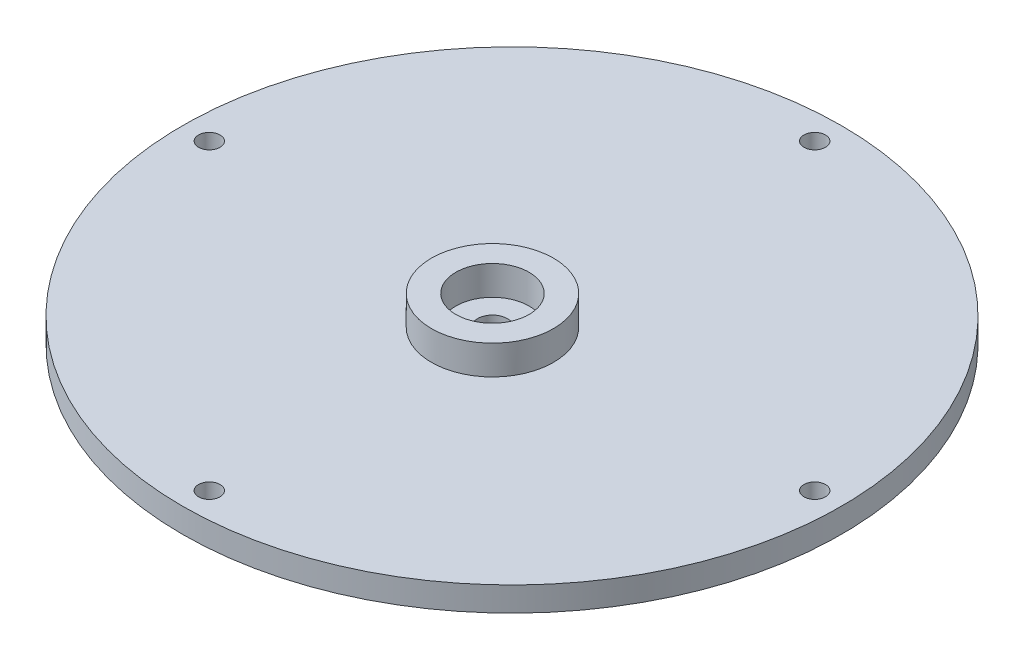
ISO-10303-21;
HEADER;
FILE_DESCRIPTION(('STEP AP214'),'2;1');
FILE_NAME('part.step','',(''),(''),'','','');
FILE_SCHEMA(('AUTOMOTIVE_DESIGN { 1 0 10303 214 1 1 1 1 }'));
ENDSEC;
DATA;
#1=APPLICATION_CONTEXT('core data for automotive mechanical design processes');
#2=APPLICATION_PROTOCOL_DEFINITION('international standard','automotive_design',2000,#1);
#3=PRODUCT_CONTEXT('',#1,'mechanical');
#4=PRODUCT('Part','Part','',(#3));
#5=PRODUCT_RELATED_PRODUCT_CATEGORY('part','',(#4));
#6=PRODUCT_DEFINITION_FORMATION('','',#4);
#7=PRODUCT_DEFINITION_CONTEXT('part definition',#1,'design');
#8=PRODUCT_DEFINITION('design','',#6,#7);
#9=PRODUCT_DEFINITION_SHAPE('','',#8);
#10=(LENGTH_UNIT() NAMED_UNIT(*) SI_UNIT(.MILLI.,.METRE.));
#11=(NAMED_UNIT(*) PLANE_ANGLE_UNIT() SI_UNIT($,.RADIAN.));
#12=(NAMED_UNIT(*) SI_UNIT($,.STERADIAN.) SOLID_ANGLE_UNIT());
#13=UNCERTAINTY_MEASURE_WITH_UNIT(LENGTH_MEASURE(1.E-05),#10,'distance_accuracy_value','');
#14=(GEOMETRIC_REPRESENTATION_CONTEXT(3) GLOBAL_UNCERTAINTY_ASSIGNED_CONTEXT((#13)) GLOBAL_UNIT_ASSIGNED_CONTEXT((#10,
#11,#12)) REPRESENTATION_CONTEXT('',''));
#15=CARTESIAN_POINT('',(0.,0.,0.));
#16=DIRECTION('',(0.,0.,1.));
#17=DIRECTION('',(1.,0.,0.));
#18=AXIS2_PLACEMENT_3D('',#15,#16,#17);
#19=CARTESIAN_POINT('',(-67.5,-5.00000000000001,0.));
#20=DIRECTION('',(0.,1.,0.));
#21=DIRECTION('',(0.,0.,1.));
#22=AXIS2_PLACEMENT_3D('',#19,#20,#21);
#23=PLANE('',#22);
#24=CARTESIAN_POINT('',(0.,-5.00000000000001,0.));
#25=DIRECTION('',(0.,-1.,0.));
#26=DIRECTION('',(0.,0.,-1.));
#27=AXIS2_PLACEMENT_3D('',#24,#25,#26);
#28=CIRCLE('',#27,50.);
#29=CARTESIAN_POINT('',(0.,-5.00000000000001,-50.));
#30=VERTEX_POINT('',#29);
#31=EDGE_CURVE('E114',#30,#30,#28,.T.);
#32=ORIENTED_EDGE('',*,*,#31,.F.);
#33=EDGE_LOOP('',(#32));
#34=FACE_BOUND('',#33,.T.);
#35=CARTESIAN_POINT('',(0.,-5.00000000000001,0.));
#36=DIRECTION('',(0.,-1.,0.));
#37=DIRECTION('',(0.,0.,-1.));
#38=AXIS2_PLACEMENT_3D('',#35,#36,#37);
#39=CIRCLE('',#38,54.);
#40=CARTESIAN_POINT('',(0.,-5.00000000000001,-54.));
#41=VERTEX_POINT('',#40);
#42=EDGE_CURVE('E218',#41,#41,#39,.T.);
#43=ORIENTED_EDGE('',*,*,#42,.T.);
#44=EDGE_LOOP('',(#43));
#45=FACE_BOUND('',#44,.T.);
#46=ADVANCED_FACE('F40',(#34,#45),#23,.F.);
#47=CARTESIAN_POINT('',(0.,0.,0.));
#48=DIRECTION('',(0.,-1.,0.));
#49=DIRECTION('',(0.,0.,-1.));
#50=AXIS2_PLACEMENT_3D('',#47,#48,#49);
#51=PLANE('',#50);
#52=CARTESIAN_POINT('',(0.,0.,-62.));
#53=DIRECTION('',(0.,1.,0.));
#54=DIRECTION('',(0.,0.,1.));
#55=AXIS2_PLACEMENT_3D('',#52,#53,#54);
#56=CIRCLE('',#55,2.2);
#57=CARTESIAN_POINT('',(0.,0.,-59.8));
#58=VERTEX_POINT('',#57);
#59=EDGE_CURVE('E70',#58,#58,#56,.T.);
#60=ORIENTED_EDGE('',*,*,#59,.F.);
#61=EDGE_LOOP('',(#60));
#62=FACE_BOUND('',#61,.T.);
#63=CARTESIAN_POINT('',(62.0000000000016,0.,-1.55351930895896E-12));
#64=DIRECTION('',(0.,1.,0.));
#65=DIRECTION('',(0.,0.,1.));
#66=AXIS2_PLACEMENT_3D('',#63,#64,#65);
#67=CIRCLE('',#66,2.2);
#68=CARTESIAN_POINT('',(62.0000000000016,0.,2.19999999999844));
#69=VERTEX_POINT('',#68);
#70=EDGE_CURVE('E236',#69,#69,#67,.T.);
#71=ORIENTED_EDGE('',*,*,#70,.F.);
#72=EDGE_LOOP('',(#71));
#73=FACE_BOUND('',#72,.T.);
#74=CARTESIAN_POINT('',(3.10703861791791E-12,0.,62.));
#75=DIRECTION('',(0.,1.,0.));
#76=DIRECTION('',(0.,0.,1.));
#77=AXIS2_PLACEMENT_3D('',#74,#75,#76);
#78=CIRCLE('',#77,2.2);
#79=CARTESIAN_POINT('',(3.10703861791791E-12,0.,64.2));
#80=VERTEX_POINT('',#79);
#81=EDGE_CURVE('E239',#80,#80,#78,.T.);
#82=ORIENTED_EDGE('',*,*,#81,.F.);
#83=EDGE_LOOP('',(#82));
#84=FACE_BOUND('',#83,.T.);
#85=CARTESIAN_POINT('',(-61.9999999999985,0.,1.56111211911367E-12));
#86=DIRECTION('',(0.,1.,0.));
#87=DIRECTION('',(0.,0.,1.));
#88=AXIS2_PLACEMENT_3D('',#85,#86,#87);
#89=CIRCLE('',#88,2.2);
#90=CARTESIAN_POINT('',(-61.9999999999985,0.,2.20000000000156));
#91=VERTEX_POINT('',#90);
#92=EDGE_CURVE('E89',#91,#91,#89,.T.);
#93=ORIENTED_EDGE('',*,*,#92,.F.);
#94=EDGE_LOOP('',(#93));
#95=FACE_BOUND('',#94,.T.);
#96=CARTESIAN_POINT('',(0.,0.,4.));
#97=DIRECTION('',(0.,-1.,0.));
#98=DIRECTION('',(0.,0.,-1.));
#99=AXIS2_PLACEMENT_3D('',#96,#97,#98);
#100=CIRCLE('',#99,12.5);
#101=CARTESIAN_POINT('',(0.,0.,-8.5));
#102=VERTEX_POINT('',#101);
#103=EDGE_CURVE('E10',#102,#102,#100,.F.);
#104=ORIENTED_EDGE('',*,*,#103,.F.);
#105=EDGE_LOOP('',(#104));
#106=FACE_BOUND('',#105,.T.);
#107=CARTESIAN_POINT('',(0.,0.,0.));
#108=DIRECTION('',(0.,-1.,0.));
#109=DIRECTION('',(0.,0.,-1.));
#110=AXIS2_PLACEMENT_3D('',#107,#108,#109);
#111=CIRCLE('',#110,67.5);
#112=CARTESIAN_POINT('',(0.,0.,-67.5));
#113=VERTEX_POINT('',#112);
#114=EDGE_CURVE('E49',#113,#113,#111,.T.);
#115=ORIENTED_EDGE('',*,*,#114,.F.);
#116=EDGE_LOOP('',(#115));
#117=FACE_BOUND('',#116,.T.);
#118=ADVANCED_FACE('F42',(#62,#73,#84,#95,#106,#117),#51,.F.);
#119=CARTESIAN_POINT('',(0.,-10.,0.));
#120=DIRECTION('',(0.,-1.,0.));
#121=DIRECTION('',(0.,0.,-1.));
#122=AXIS2_PLACEMENT_3D('',#119,#120,#121);
#123=CYLINDRICAL_SURFACE('',#122,67.5);
#124=CARTESIAN_POINT('',(0.,-5.00000000000001,0.));
#125=DIRECTION('',(0.,-1.,0.));
#126=DIRECTION('',(0.,0.,-1.));
#127=AXIS2_PLACEMENT_3D('',#124,#125,#126);
#128=CIRCLE('',#127,67.5);
#129=CARTESIAN_POINT('',(0.,-5.00000000000001,-67.5));
#130=VERTEX_POINT('',#129);
#131=EDGE_CURVE('E55',#130,#130,#128,.T.);
#132=ORIENTED_EDGE('',*,*,#131,.F.);
#133=EDGE_LOOP('',(#132));
#134=FACE_BOUND('',#133,.T.);
#135=ORIENTED_EDGE('',*,*,#114,.T.);
#136=EDGE_LOOP('',(#135));
#137=FACE_BOUND('',#136,.T.);
#138=ADVANCED_FACE('F123',(#134,#137),#123,.T.);
#139=CARTESIAN_POINT('',(0.,-5.00000000000001,0.));
#140=DIRECTION('',(0.,-1.,0.));
#141=DIRECTION('',(0.,0.,-1.));
#142=AXIS2_PLACEMENT_3D('',#139,#140,#141);
#143=CIRCLE('',#142,57.);
#144=CARTESIAN_POINT('',(0.,-5.00000000000001,-57.));
#145=VERTEX_POINT('',#144);
#146=EDGE_CURVE('E179',#145,#145,#143,.T.);
#147=ORIENTED_EDGE('',*,*,#146,.F.);
#148=EDGE_LOOP('',(#147));
#149=FACE_BOUND('',#148,.T.);
#150=CARTESIAN_POINT('',(0.,-5.00000000000001,-62.));
#151=DIRECTION('',(0.,1.,0.));
#152=DIRECTION('',(0.,0.,1.));
#153=AXIS2_PLACEMENT_3D('',#150,#151,#152);
#154=CIRCLE('',#153,2.2);
#155=CARTESIAN_POINT('',(0.,-5.00000000000001,-59.8));
#156=VERTEX_POINT('',#155);
#157=EDGE_CURVE('E44',#156,#156,#154,.T.);
#158=ORIENTED_EDGE('',*,*,#157,.T.);
#159=EDGE_LOOP('',(#158));
#160=FACE_BOUND('',#159,.T.);
#161=CARTESIAN_POINT('',(62.0000000000016,-5.00000000000001,-1.55351930895896E-12));
#162=DIRECTION('',(0.,1.,0.));
#163=DIRECTION('',(0.,0.,1.));
#164=AXIS2_PLACEMENT_3D('',#161,#162,#163);
#165=CIRCLE('',#164,2.2);
#166=CARTESIAN_POINT('',(62.0000000000016,-5.00000000000001,2.19999999999844));
#167=VERTEX_POINT('',#166);
#168=EDGE_CURVE('E73',#167,#167,#165,.T.);
#169=ORIENTED_EDGE('',*,*,#168,.T.);
#170=EDGE_LOOP('',(#169));
#171=FACE_BOUND('',#170,.T.);
#172=CARTESIAN_POINT('',(3.10703861791791E-12,-5.00000000000001,62.));
#173=DIRECTION('',(0.,1.,0.));
#174=DIRECTION('',(0.,0.,1.));
#175=AXIS2_PLACEMENT_3D('',#172,#173,#174);
#176=CIRCLE('',#175,2.2);
#177=CARTESIAN_POINT('',(3.10703861791791E-12,-5.00000000000001,64.2));
#178=VERTEX_POINT('',#177);
#179=EDGE_CURVE('E69',#178,#178,#176,.T.);
#180=ORIENTED_EDGE('',*,*,#179,.T.);
#181=EDGE_LOOP('',(#180));
#182=FACE_BOUND('',#181,.T.);
#183=CARTESIAN_POINT('',(-61.9999999999985,-5.00000000000001,1.56111211911367E-12));
#184=DIRECTION('',(0.,1.,0.));
#185=DIRECTION('',(0.,0.,1.));
#186=AXIS2_PLACEMENT_3D('',#183,#184,#185);
#187=CIRCLE('',#186,2.2);
#188=CARTESIAN_POINT('',(-61.9999999999985,-5.00000000000001,2.20000000000156));
#189=VERTEX_POINT('',#188);
#190=EDGE_CURVE('E65',#189,#189,#187,.T.);
#191=ORIENTED_EDGE('',*,*,#190,.T.);
#192=EDGE_LOOP('',(#191));
#193=FACE_BOUND('',#192,.T.);
#194=ORIENTED_EDGE('',*,*,#131,.T.);
#195=EDGE_LOOP('',(#194));
#196=FACE_BOUND('',#195,.T.);
#197=ADVANCED_FACE('F121',(#149,#160,#171,#182,#193,#196),#23,.F.);
#198=CARTESIAN_POINT('',(0.,-10.,0.));
#199=DIRECTION('',(0.,-1.,0.));
#200=DIRECTION('',(0.,0.,-1.));
#201=AXIS2_PLACEMENT_3D('',#198,#199,#200);
#202=CYLINDRICAL_SURFACE('',#201,50.);
#203=CARTESIAN_POINT('',(0.,-10.,0.));
#204=DIRECTION('',(0.,-1.,0.));
#205=DIRECTION('',(0.,0.,-1.));
#206=AXIS2_PLACEMENT_3D('',#203,#204,#205);
#207=CIRCLE('',#206,50.);
#208=CARTESIAN_POINT('',(0.,-10.,-50.));
#209=VERTEX_POINT('',#208);
#210=EDGE_CURVE('E110',#209,#209,#207,.T.);
#211=ORIENTED_EDGE('',*,*,#210,.F.);
#212=EDGE_LOOP('',(#211));
#213=FACE_BOUND('',#212,.T.);
#214=ORIENTED_EDGE('',*,*,#31,.T.);
#215=EDGE_LOOP('',(#214));
#216=FACE_BOUND('',#215,.T.);
#217=ADVANCED_FACE('F169',(#213,#216),#202,.T.);
#218=CARTESIAN_POINT('',(-50.,-10.,0.));
#219=DIRECTION('',(0.,1.,0.));
#220=DIRECTION('',(0.,0.,1.));
#221=AXIS2_PLACEMENT_3D('',#218,#219,#220);
#222=PLANE('',#221);
#223=CARTESIAN_POINT('',(0.,-10.,4.));
#224=DIRECTION('',(0.,-1.,0.));
#225=DIRECTION('',(0.,0.,-1.));
#226=AXIS2_PLACEMENT_3D('',#223,#224,#225);
#227=CIRCLE('',#226,10.5);
#228=CARTESIAN_POINT('',(0.,-10.,-6.5));
#229=VERTEX_POINT('',#228);
#230=EDGE_CURVE('E63',#229,#229,#227,.T.);
#231=ORIENTED_EDGE('',*,*,#230,.F.);
#232=EDGE_LOOP('',(#231));
#233=FACE_BOUND('',#232,.T.);
#234=ORIENTED_EDGE('',*,*,#210,.T.);
#235=EDGE_LOOP('',(#234));
#236=FACE_BOUND('',#235,.T.);
#237=ADVANCED_FACE('F164',(#233,#236),#222,.F.);
#238=CARTESIAN_POINT('',(0.,6.,4.));
#239=DIRECTION('',(0.,1.,0.));
#240=DIRECTION('',(0.,0.,1.));
#241=AXIS2_PLACEMENT_3D('',#238,#239,#240);
#242=PLANE('',#241);
#243=CARTESIAN_POINT('',(0.,6.,4.));
#244=DIRECTION('',(0.,1.,0.));
#245=DIRECTION('',(0.,0.,1.));
#246=AXIS2_PLACEMENT_3D('',#243,#244,#245);
#247=CIRCLE('',#246,12.5);
#248=CARTESIAN_POINT('',(0.,6.,16.5));
#249=VERTEX_POINT('',#248);
#250=EDGE_CURVE('E103',#249,#249,#247,.T.);
#251=ORIENTED_EDGE('',*,*,#250,.T.);
#252=EDGE_LOOP('',(#251));
#253=FACE_BOUND('',#252,.T.);
#254=CARTESIAN_POINT('',(0.,6.,4.));
#255=DIRECTION('',(0.,1.,0.));
#256=DIRECTION('',(0.,0.,1.));
#257=AXIS2_PLACEMENT_3D('',#254,#255,#256);
#258=CIRCLE('',#257,7.5);
#259=CARTESIAN_POINT('',(0.,6.,11.5));
#260=VERTEX_POINT('',#259);
#261=EDGE_CURVE('E99',#260,#260,#258,.T.);
#262=ORIENTED_EDGE('',*,*,#261,.F.);
#263=EDGE_LOOP('',(#262));
#264=FACE_BOUND('',#263,.T.);
#265=ADVANCED_FACE('F158',(#253,#264),#242,.T.);
#266=CARTESIAN_POINT('',(0.,6.,4.));
#267=DIRECTION('',(0.,-1.,0.));
#268=DIRECTION('',(0.,0.,-1.));
#269=AXIS2_PLACEMENT_3D('',#266,#267,#268);
#270=CYLINDRICAL_SURFACE('',#269,12.5);
#271=ORIENTED_EDGE('',*,*,#250,.F.);
#272=EDGE_LOOP('',(#271));
#273=FACE_BOUND('',#272,.T.);
#274=ORIENTED_EDGE('',*,*,#103,.T.);
#275=EDGE_LOOP('',(#274));
#276=FACE_BOUND('',#275,.T.);
#277=ADVANCED_FACE('F149',(#273,#276),#270,.T.);
#278=CARTESIAN_POINT('',(0.,6.,4.));
#279=DIRECTION('',(0.,-1.,0.));
#280=DIRECTION('',(0.,0.,-1.));
#281=AXIS2_PLACEMENT_3D('',#278,#279,#280);
#282=CYLINDRICAL_SURFACE('',#281,7.5);
#283=ORIENTED_EDGE('',*,*,#261,.T.);
#284=EDGE_LOOP('',(#283));
#285=FACE_BOUND('',#284,.T.);
#286=CARTESIAN_POINT('',(0.,0.,4.));
#287=DIRECTION('',(0.,1.,0.));
#288=DIRECTION('',(0.,0.,1.));
#289=AXIS2_PLACEMENT_3D('',#286,#287,#288);
#290=CIRCLE('',#289,7.5);
#291=CARTESIAN_POINT('',(0.,0.,11.5));
#292=VERTEX_POINT('',#291);
#293=EDGE_CURVE('E95',#292,#292,#290,.T.);
#294=ORIENTED_EDGE('',*,*,#293,.F.);
#295=EDGE_LOOP('',(#294));
#296=FACE_BOUND('',#295,.T.);
#297=ADVANCED_FACE('F140',(#285,#296),#282,.F.);
#298=CARTESIAN_POINT('',(0.,0.,4.));
#299=DIRECTION('',(0.,1.,0.));
#300=DIRECTION('',(0.,0.,1.));
#301=AXIS2_PLACEMENT_3D('',#298,#299,#300);
#302=CIRCLE('',#301,3.05);
#303=CARTESIAN_POINT('',(0.,0.,7.05));
#304=VERTEX_POINT('',#303);
#305=EDGE_CURVE('E64',#304,#304,#302,.T.);
#306=ORIENTED_EDGE('',*,*,#305,.F.);
#307=EDGE_LOOP('',(#306));
#308=FACE_BOUND('',#307,.T.);
#309=ORIENTED_EDGE('',*,*,#293,.T.);
#310=EDGE_LOOP('',(#309));
#311=FACE_BOUND('',#310,.T.);
#312=ADVANCED_FACE('F130',(#308,#311),#51,.F.);
#313=CARTESIAN_POINT('',(0.,-7.00000000000001,4.));
#314=DIRECTION('',(0.,-1.,0.));
#315=DIRECTION('',(0.,0.,-1.));
#316=AXIS2_PLACEMENT_3D('',#313,#314,#315);
#317=CYLINDRICAL_SURFACE('',#316,10.5);
#318=CARTESIAN_POINT('',(0.,-7.00000000000001,4.));
#319=DIRECTION('',(0.,-1.,0.));
#320=DIRECTION('',(0.,0.,-1.));
#321=AXIS2_PLACEMENT_3D('',#318,#319,#320);
#322=CIRCLE('',#321,10.5);
#323=CARTESIAN_POINT('',(0.,-7.00000000000001,-6.5));
#324=VERTEX_POINT('',#323);
#325=EDGE_CURVE('E91',#324,#324,#322,.T.);
#326=ORIENTED_EDGE('',*,*,#325,.F.);
#327=EDGE_LOOP('',(#326));
#328=FACE_BOUND('',#327,.T.);
#329=ORIENTED_EDGE('',*,*,#230,.T.);
#330=EDGE_LOOP('',(#329));
#331=FACE_BOUND('',#330,.T.);
#332=ADVANCED_FACE('F139',(#328,#331),#317,.F.);
#333=CARTESIAN_POINT('',(0.,-7.00000000000001,4.));
#334=DIRECTION('',(0.,-1.,0.));
#335=DIRECTION('',(0.,0.,-1.));
#336=AXIS2_PLACEMENT_3D('',#333,#334,#335);
#337=PLANE('',#336);
#338=CARTESIAN_POINT('',(0.,-7.00000000000001,4.));
#339=DIRECTION('',(0.,-1.,0.));
#340=DIRECTION('',(0.,0.,-1.));
#341=AXIS2_PLACEMENT_3D('',#338,#339,#340);
#342=CIRCLE('',#341,3.05);
#343=CARTESIAN_POINT('',(0.,-7.00000000000001,0.95));
#344=VERTEX_POINT('',#343);
#345=EDGE_CURVE('E59',#344,#344,#342,.T.);
#346=ORIENTED_EDGE('',*,*,#345,.F.);
#347=EDGE_LOOP('',(#346));
#348=FACE_BOUND('',#347,.T.);
#349=ORIENTED_EDGE('',*,*,#325,.T.);
#350=EDGE_LOOP('',(#349));
#351=FACE_BOUND('',#350,.T.);
#352=ADVANCED_FACE('F146',(#348,#351),#337,.T.);
#353=CARTESIAN_POINT('',(0.,-10.,4.));
#354=DIRECTION('',(0.,1.,0.));
#355=DIRECTION('',(0.,0.,1.));
#356=AXIS2_PLACEMENT_3D('',#353,#354,#355);
#357=CYLINDRICAL_SURFACE('',#356,3.05);
#358=ORIENTED_EDGE('',*,*,#345,.T.);
#359=EDGE_LOOP('',(#358));
#360=FACE_BOUND('',#359,.T.);
#361=ORIENTED_EDGE('',*,*,#305,.T.);
#362=EDGE_LOOP('',(#361));
#363=FACE_BOUND('',#362,.T.);
#364=ADVANCED_FACE('F188',(#360,#363),#357,.F.);
#365=CARTESIAN_POINT('',(-61.9999999999985,-10.,1.56111211911367E-12));
#366=DIRECTION('',(0.,1.,0.));
#367=DIRECTION('',(0.,0.,1.));
#368=AXIS2_PLACEMENT_3D('',#365,#366,#367);
#369=CYLINDRICAL_SURFACE('',#368,2.2);
#370=ORIENTED_EDGE('',*,*,#92,.T.);
#371=EDGE_LOOP('',(#370));
#372=FACE_BOUND('',#371,.T.);
#373=ORIENTED_EDGE('',*,*,#190,.F.);
#374=EDGE_LOOP('',(#373));
#375=FACE_BOUND('',#374,.T.);
#376=ADVANCED_FACE('F185',(#372,#375),#369,.F.);
#377=CARTESIAN_POINT('',(3.10703861791791E-12,-10.,62.));
#378=DIRECTION('',(0.,1.,0.));
#379=DIRECTION('',(0.,0.,1.));
#380=AXIS2_PLACEMENT_3D('',#377,#378,#379);
#381=CYLINDRICAL_SURFACE('',#380,2.2);
#382=ORIENTED_EDGE('',*,*,#81,.T.);
#383=EDGE_LOOP('',(#382));
#384=FACE_BOUND('',#383,.T.);
#385=ORIENTED_EDGE('',*,*,#179,.F.);
#386=EDGE_LOOP('',(#385));
#387=FACE_BOUND('',#386,.T.);
#388=ADVANCED_FACE('F187',(#384,#387),#381,.F.);
#389=CARTESIAN_POINT('',(62.0000000000016,-10.,-1.55351930895896E-12));
#390=DIRECTION('',(0.,1.,0.));
#391=DIRECTION('',(0.,0.,1.));
#392=AXIS2_PLACEMENT_3D('',#389,#390,#391);
#393=CYLINDRICAL_SURFACE('',#392,2.2);
#394=ORIENTED_EDGE('',*,*,#70,.T.);
#395=EDGE_LOOP('',(#394));
#396=FACE_BOUND('',#395,.T.);
#397=ORIENTED_EDGE('',*,*,#168,.F.);
#398=EDGE_LOOP('',(#397));
#399=FACE_BOUND('',#398,.T.);
#400=ADVANCED_FACE('F195',(#396,#399),#393,.F.);
#401=CARTESIAN_POINT('',(0.,-10.,-62.));
#402=DIRECTION('',(0.,1.,0.));
#403=DIRECTION('',(0.,0.,1.));
#404=AXIS2_PLACEMENT_3D('',#401,#402,#403);
#405=CYLINDRICAL_SURFACE('',#404,2.2);
#406=ORIENTED_EDGE('',*,*,#59,.T.);
#407=EDGE_LOOP('',(#406));
#408=FACE_BOUND('',#407,.T.);
#409=ORIENTED_EDGE('',*,*,#157,.F.);
#410=EDGE_LOOP('',(#409));
#411=FACE_BOUND('',#410,.T.);
#412=ADVANCED_FACE('F253',(#408,#411),#405,.F.);
#413=CARTESIAN_POINT('',(0.,-3.00000000000001,0.));
#414=DIRECTION('',(0.,-1.,0.));
#415=DIRECTION('',(0.,0.,-1.));
#416=AXIS2_PLACEMENT_3D('',#413,#414,#415);
#417=CYLINDRICAL_SURFACE('',#416,57.);
#418=CARTESIAN_POINT('',(0.,-3.00000000000001,0.));
#419=DIRECTION('',(0.,-1.,0.));
#420=DIRECTION('',(0.,0.,-1.));
#421=AXIS2_PLACEMENT_3D('',#418,#419,#420);
#422=CIRCLE('',#421,57.);
#423=CARTESIAN_POINT('',(0.,-3.00000000000001,-57.));
#424=VERTEX_POINT('',#423);
#425=EDGE_CURVE('E227',#424,#424,#422,.T.);
#426=ORIENTED_EDGE('',*,*,#425,.F.);
#427=EDGE_LOOP('',(#426));
#428=FACE_BOUND('',#427,.T.);
#429=ORIENTED_EDGE('',*,*,#146,.T.);
#430=EDGE_LOOP('',(#429));
#431=FACE_BOUND('',#430,.T.);
#432=ADVANCED_FACE('F257',(#428,#431),#417,.F.);
#433=CARTESIAN_POINT('',(0.,-3.00000000000001,0.));
#434=DIRECTION('',(0.,-1.,0.));
#435=DIRECTION('',(0.,0.,-1.));
#436=AXIS2_PLACEMENT_3D('',#433,#434,#435);
#437=PLANE('',#436);
#438=CARTESIAN_POINT('',(0.,-3.00000000000001,0.));
#439=DIRECTION('',(0.,-1.,0.));
#440=DIRECTION('',(0.,0.,-1.));
#441=AXIS2_PLACEMENT_3D('',#438,#439,#440);
#442=CIRCLE('',#441,54.);
#443=CARTESIAN_POINT('',(0.,-3.00000000000001,-54.));
#444=VERTEX_POINT('',#443);
#445=EDGE_CURVE('E221',#444,#444,#442,.T.);
#446=ORIENTED_EDGE('',*,*,#445,.F.);
#447=EDGE_LOOP('',(#446));
#448=FACE_BOUND('',#447,.T.);
#449=ORIENTED_EDGE('',*,*,#425,.T.);
#450=EDGE_LOOP('',(#449));
#451=FACE_BOUND('',#450,.T.);
#452=ADVANCED_FACE('F263',(#448,#451),#437,.T.);
#453=CARTESIAN_POINT('',(0.,-3.00000000000001,0.));
#454=DIRECTION('',(0.,-1.,0.));
#455=DIRECTION('',(0.,0.,-1.));
#456=AXIS2_PLACEMENT_3D('',#453,#454,#455);
#457=CYLINDRICAL_SURFACE('',#456,54.);
#458=ORIENTED_EDGE('',*,*,#445,.T.);
#459=EDGE_LOOP('',(#458));
#460=FACE_BOUND('',#459,.T.);
#461=ORIENTED_EDGE('',*,*,#42,.F.);
#462=EDGE_LOOP('',(#461));
#463=FACE_BOUND('',#462,.T.);
#464=ADVANCED_FACE('F267',(#460,#463),#457,.T.);
#465=CLOSED_SHELL('',(#46,#118,#138,#197,#217,#237,#265,#277,#297,#312,#332,#352,#364,#376,#388,
#400,#412,#432,#452,#464));
#466=MANIFOLD_SOLID_BREP('B2',#465);
#467=ADVANCED_BREP_SHAPE_REPRESENTATION('',(#18,#466),#14);
#468=SHAPE_DEFINITION_REPRESENTATION(#9,#467);
ENDSEC;
END-ISO-10303-21;
